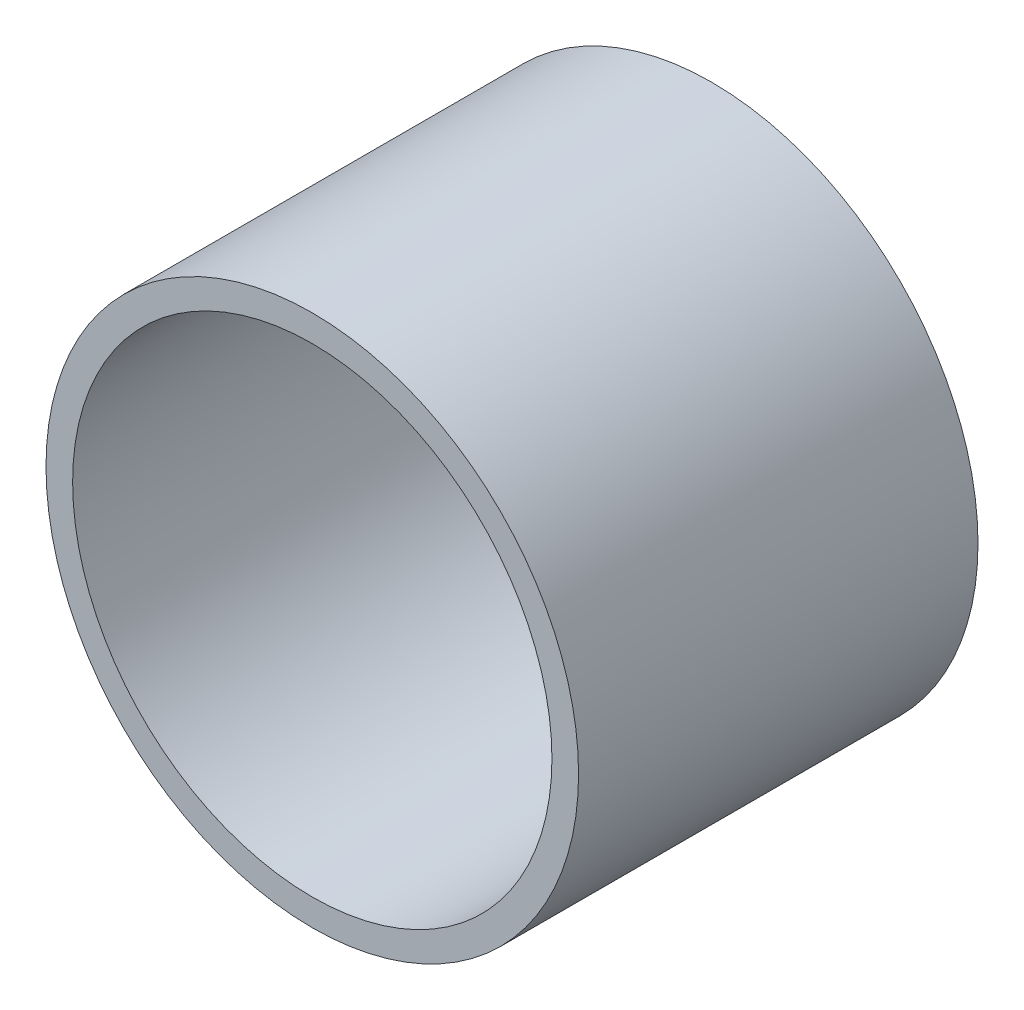
ISO-10303-21;
HEADER;
FILE_DESCRIPTION(('STEP AP214'),'2;1');
FILE_NAME('part.step','',(''),(''),'','','');
FILE_SCHEMA(('AUTOMOTIVE_DESIGN { 1 0 10303 214 1 1 1 1 }'));
ENDSEC;
DATA;
#1=APPLICATION_CONTEXT('core data for automotive mechanical design processes');
#2=APPLICATION_PROTOCOL_DEFINITION('international standard','automotive_design',2000,#1);
#3=PRODUCT_CONTEXT('',#1,'mechanical');
#4=PRODUCT('Part','Part','',(#3));
#5=PRODUCT_RELATED_PRODUCT_CATEGORY('part','',(#4));
#6=PRODUCT_DEFINITION_FORMATION('','',#4);
#7=PRODUCT_DEFINITION_CONTEXT('part definition',#1,'design');
#8=PRODUCT_DEFINITION('design','',#6,#7);
#9=PRODUCT_DEFINITION_SHAPE('','',#8);
#10=(LENGTH_UNIT() NAMED_UNIT(*) SI_UNIT(.MILLI.,.METRE.));
#11=(NAMED_UNIT(*) PLANE_ANGLE_UNIT() SI_UNIT($,.RADIAN.));
#12=(NAMED_UNIT(*) SI_UNIT($,.STERADIAN.) SOLID_ANGLE_UNIT());
#13=UNCERTAINTY_MEASURE_WITH_UNIT(LENGTH_MEASURE(1.E-05),#10,'distance_accuracy_value','');
#14=(GEOMETRIC_REPRESENTATION_CONTEXT(3) GLOBAL_UNCERTAINTY_ASSIGNED_CONTEXT((#13)) GLOBAL_UNIT_ASSIGNED_CONTEXT((#10,
#11,#12)) REPRESENTATION_CONTEXT('',''));
#15=CARTESIAN_POINT('',(0.,0.,0.));
#16=DIRECTION('',(0.,0.,1.));
#17=DIRECTION('',(1.,0.,0.));
#18=AXIS2_PLACEMENT_3D('',#15,#16,#17);
#19=CARTESIAN_POINT('',(0.,0.,6.));
#20=DIRECTION('',(0.,0.,-1.));
#21=DIRECTION('',(-1.,0.,0.));
#22=AXIS2_PLACEMENT_3D('',#19,#20,#21);
#23=CYLINDRICAL_SURFACE('',#22,3.6);
#24=CARTESIAN_POINT('',(0.,0.,0.));
#25=DIRECTION('',(0.,0.,-1.));
#26=DIRECTION('',(-1.,0.,0.));
#27=AXIS2_PLACEMENT_3D('',#24,#25,#26);
#28=CIRCLE('',#27,3.6);
#29=CARTESIAN_POINT('',(-3.6,0.,0.));
#30=VERTEX_POINT('',#29);
#31=EDGE_CURVE('E26',#30,#30,#28,.T.);
#32=ORIENTED_EDGE('',*,*,#31,.T.);
#33=EDGE_LOOP('',(#32));
#34=FACE_BOUND('',#33,.T.);
#35=CARTESIAN_POINT('',(0.,0.,6.));
#36=DIRECTION('',(0.,0.,-1.));
#37=DIRECTION('',(-1.,0.,0.));
#38=AXIS2_PLACEMENT_3D('',#35,#36,#37);
#39=CIRCLE('',#38,3.6);
#40=CARTESIAN_POINT('',(-3.6,0.,6.));
#41=VERTEX_POINT('',#40);
#42=EDGE_CURVE('E17',#41,#41,#39,.T.);
#43=ORIENTED_EDGE('',*,*,#42,.F.);
#44=EDGE_LOOP('',(#43));
#45=FACE_BOUND('',#44,.T.);
#46=ADVANCED_FACE('F14',(#34,#45),#23,.F.);
#47=CARTESIAN_POINT('',(0.,0.,6.));
#48=DIRECTION('',(0.,0.,1.));
#49=DIRECTION('',(1.,0.,0.));
#50=AXIS2_PLACEMENT_3D('',#47,#48,#49);
#51=PLANE('',#50);
#52=ORIENTED_EDGE('',*,*,#42,.T.);
#53=EDGE_LOOP('',(#52));
#54=FACE_BOUND('',#53,.T.);
#55=CARTESIAN_POINT('',(0.,0.,6.));
#56=DIRECTION('',(0.,0.,-1.));
#57=DIRECTION('',(-1.,0.,0.));
#58=AXIS2_PLACEMENT_3D('',#55,#56,#57);
#59=CIRCLE('',#58,4.);
#60=CARTESIAN_POINT('',(-4.,0.,6.));
#61=VERTEX_POINT('',#60);
#62=EDGE_CURVE('E21',#61,#61,#59,.T.);
#63=ORIENTED_EDGE('',*,*,#62,.F.);
#64=EDGE_LOOP('',(#63));
#65=FACE_BOUND('',#64,.T.);
#66=ADVANCED_FACE('F34',(#54,#65),#51,.T.);
#67=CARTESIAN_POINT('',(0.,0.,0.));
#68=DIRECTION('',(0.,0.,1.));
#69=DIRECTION('',(1.,0.,0.));
#70=AXIS2_PLACEMENT_3D('',#67,#68,#69);
#71=PLANE('',#70);
#72=ORIENTED_EDGE('',*,*,#31,.F.);
#73=EDGE_LOOP('',(#72));
#74=FACE_BOUND('',#73,.T.);
#75=CARTESIAN_POINT('',(0.,0.,0.));
#76=DIRECTION('',(0.,0.,-1.));
#77=DIRECTION('',(-1.,0.,0.));
#78=AXIS2_PLACEMENT_3D('',#75,#76,#77);
#79=CIRCLE('',#78,4.);
#80=CARTESIAN_POINT('',(-4.,0.,0.));
#81=VERTEX_POINT('',#80);
#82=EDGE_CURVE('E10',#81,#81,#79,.F.);
#83=ORIENTED_EDGE('',*,*,#82,.F.);
#84=EDGE_LOOP('',(#83));
#85=FACE_BOUND('',#84,.T.);
#86=ADVANCED_FACE('F42',(#74,#85),#71,.F.);
#87=CARTESIAN_POINT('',(0.,0.,6.));
#88=DIRECTION('',(0.,0.,-1.));
#89=DIRECTION('',(-1.,0.,0.));
#90=AXIS2_PLACEMENT_3D('',#87,#88,#89);
#91=CYLINDRICAL_SURFACE('',#90,4.);
#92=ORIENTED_EDGE('',*,*,#82,.T.);
#93=EDGE_LOOP('',(#92));
#94=FACE_BOUND('',#93,.T.);
#95=ORIENTED_EDGE('',*,*,#62,.T.);
#96=EDGE_LOOP('',(#95));
#97=FACE_BOUND('',#96,.T.);
#98=ADVANCED_FACE('F43',(#94,#97),#91,.T.);
#99=CLOSED_SHELL('',(#46,#66,#86,#98));
#100=MANIFOLD_SOLID_BREP('B1',#99);
#101=ADVANCED_BREP_SHAPE_REPRESENTATION('',(#18,#100),#14);
#102=SHAPE_DEFINITION_REPRESENTATION(#9,#101);
ENDSEC;
END-ISO-10303-21;
